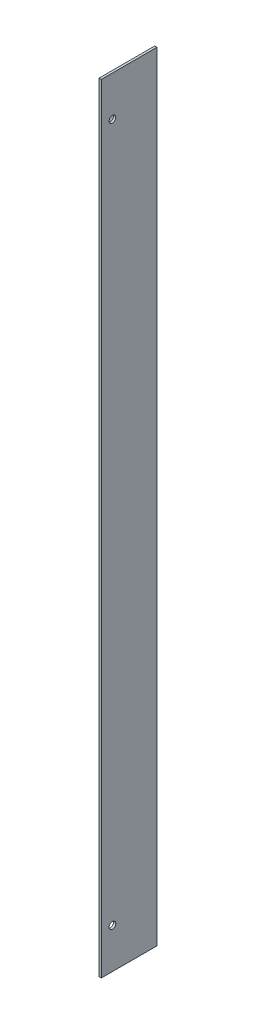
ISO-10303-21;
HEADER;
FILE_DESCRIPTION(('STEP AP214'),'2;1');
FILE_NAME('part.step','',(''),(''),'','','');
FILE_SCHEMA(('AUTOMOTIVE_DESIGN { 1 0 10303 214 1 1 1 1 }'));
ENDSEC;
DATA;
#1=APPLICATION_CONTEXT('core data for automotive mechanical design processes');
#2=APPLICATION_PROTOCOL_DEFINITION('international standard','automotive_design',2000,#1);
#3=PRODUCT_CONTEXT('',#1,'mechanical');
#4=PRODUCT('Part','Part','',(#3));
#5=PRODUCT_RELATED_PRODUCT_CATEGORY('part','',(#4));
#6=PRODUCT_DEFINITION_FORMATION('','',#4);
#7=PRODUCT_DEFINITION_CONTEXT('part definition',#1,'design');
#8=PRODUCT_DEFINITION('design','',#6,#7);
#9=PRODUCT_DEFINITION_SHAPE('','',#8);
#10=(LENGTH_UNIT() NAMED_UNIT(*) SI_UNIT(.MILLI.,.METRE.));
#11=(NAMED_UNIT(*) PLANE_ANGLE_UNIT() SI_UNIT($,.RADIAN.));
#12=(NAMED_UNIT(*) SI_UNIT($,.STERADIAN.) SOLID_ANGLE_UNIT());
#13=UNCERTAINTY_MEASURE_WITH_UNIT(LENGTH_MEASURE(1.E-05),#10,'distance_accuracy_value','');
#14=(GEOMETRIC_REPRESENTATION_CONTEXT(3) GLOBAL_UNCERTAINTY_ASSIGNED_CONTEXT((#13)) GLOBAL_UNIT_ASSIGNED_CONTEXT((#10,
#11,#12)) REPRESENTATION_CONTEXT('',''));
#15=CARTESIAN_POINT('',(0.,0.,0.));
#16=DIRECTION('',(0.,0.,1.));
#17=DIRECTION('',(1.,0.,0.));
#18=AXIS2_PLACEMENT_3D('',#15,#16,#17);
#19=CARTESIAN_POINT('',(-55.4417853066137,61.1803752262789,25.));
#20=DIRECTION('',(1.,0.,0.));
#21=DIRECTION('',(0.,1.,0.));
#22=AXIS2_PLACEMENT_3D('',#19,#20,#21);
#23=PLANE('',#22);
#24=CARTESIAN_POINT('',(-55.4417853066137,43.1803752262789,20.));
#25=DIRECTION('',(1.,0.,0.));
#26=DIRECTION('',(0.,1.,0.));
#27=AXIS2_PLACEMENT_3D('',#24,#25,#26);
#28=CIRCLE('',#27,1.5);
#29=CARTESIAN_POINT('',(-55.4417853066137,44.6803752262789,20.));
#30=VERTEX_POINT('',#29);
#31=EDGE_CURVE('E149',#30,#30,#28,.T.);
#32=ORIENTED_EDGE('',*,*,#31,.T.);
#33=EDGE_LOOP('',(#32));
#34=FACE_BOUND('',#33,.T.);
#35=CARTESIAN_POINT('',(-55.4417853066137,-270.819624773721,20.));
#36=DIRECTION('',(1.,0.,0.));
#37=DIRECTION('',(0.,1.,0.));
#38=AXIS2_PLACEMENT_3D('',#35,#36,#37);
#39=CIRCLE('',#38,1.5);
#40=CARTESIAN_POINT('',(-55.4417853066137,-269.319624773721,20.));
#41=VERTEX_POINT('',#40);
#42=EDGE_CURVE('E140',#41,#41,#39,.T.);
#43=ORIENTED_EDGE('',*,*,#42,.T.);
#44=EDGE_LOOP('',(#43));
#45=FACE_BOUND('',#44,.T.);
#46=DIRECTION('',(0.,1.,0.));
#47=VECTOR('',#46,1.);
#48=CARTESIAN_POINT('',(-55.4417853066131,61.1803752262784,1.));
#49=LINE('',#48,#47);
#50=CARTESIAN_POINT('',(-55.4417853066137,-288.819624773721,1.));
#51=VERTEX_POINT('',#50);
#52=CARTESIAN_POINT('',(-55.4417853066131,61.1803752262784,1.));
#53=VERTEX_POINT('',#52);
#54=EDGE_CURVE('E48',#51,#53,#49,.T.);
#55=ORIENTED_EDGE('',*,*,#54,.F.);
#56=DIRECTION('',(0.,0.,-1.));
#57=VECTOR('',#56,1.);
#58=CARTESIAN_POINT('',(-55.4417853066137,-288.819624773721,25.));
#59=LINE('',#58,#57);
#60=CARTESIAN_POINT('',(-55.4417853066137,-288.819624773721,25.));
#61=VERTEX_POINT('',#60);
#62=EDGE_CURVE('E11',#61,#51,#59,.T.);
#63=ORIENTED_EDGE('',*,*,#62,.F.);
#64=DIRECTION('',(0.,-1.,0.));
#65=VECTOR('',#64,1.);
#66=CARTESIAN_POINT('',(-55.4417853066137,61.1803752262789,25.));
#67=LINE('',#66,#65);
#68=CARTESIAN_POINT('',(-55.4417853066137,61.1803752262789,25.));
#69=VERTEX_POINT('',#68);
#70=EDGE_CURVE('E101',#69,#61,#67,.T.);
#71=ORIENTED_EDGE('',*,*,#70,.F.);
#72=DIRECTION('',(0.,0.,-1.));
#73=VECTOR('',#72,1.);
#74=CARTESIAN_POINT('',(-55.4417853066137,61.1803752262789,25.));
#75=LINE('',#74,#73);
#76=EDGE_CURVE('E100',#69,#53,#75,.T.);
#77=ORIENTED_EDGE('',*,*,#76,.T.);
#78=EDGE_LOOP('',(#55,#63,#71,#77));
#79=FACE_BOUND('',#78,.T.);
#80=ADVANCED_FACE('F32',(#34,#45,#79),#23,.F.);
#81=CARTESIAN_POINT('',(-55.4417853066137,-288.819624773721,25.));
#82=DIRECTION('',(0.,1.,0.));
#83=DIRECTION('',(0.,0.,1.));
#84=AXIS2_PLACEMENT_3D('',#81,#82,#83);
#85=PLANE('',#84);
#86=DIRECTION('',(1.,0.,0.));
#87=VECTOR('',#86,1.);
#88=CARTESIAN_POINT('',(-55.4417853066137,-288.819624773721,0.));
#89=LINE('',#88,#87);
#90=CARTESIAN_POINT('',(-55.4417853066137,-288.819624773721,0.));
#91=VERTEX_POINT('',#90);
#92=CARTESIAN_POINT('',(-54.4417853066137,-288.819624773721,0.));
#93=VERTEX_POINT('',#92);
#94=EDGE_CURVE('E152',#91,#93,#89,.T.);
#95=ORIENTED_EDGE('',*,*,#94,.T.);
#96=DIRECTION('',(0.,0.,-1.));
#97=VECTOR('',#96,1.);
#98=CARTESIAN_POINT('',(-54.4417853066137,-288.819624773721,25.));
#99=LINE('',#98,#97);
#100=CARTESIAN_POINT('',(-54.4417853066137,-288.819624773721,25.));
#101=VERTEX_POINT('',#100);
#102=EDGE_CURVE('E40',#101,#93,#99,.T.);
#103=ORIENTED_EDGE('',*,*,#102,.F.);
#104=DIRECTION('',(1.,0.,0.));
#105=VECTOR('',#104,1.);
#106=CARTESIAN_POINT('',(-55.4417853066137,-288.819624773721,25.));
#107=LINE('',#106,#105);
#108=EDGE_CURVE('E85',#61,#101,#107,.T.);
#109=ORIENTED_EDGE('',*,*,#108,.F.);
#110=ORIENTED_EDGE('',*,*,#62,.T.);
#111=DIRECTION('',(0.,0.,-1.));
#112=VECTOR('',#111,1.);
#113=CARTESIAN_POINT('',(-55.4417853066131,-288.819624773722,1.));
#114=LINE('',#113,#112);
#115=EDGE_CURVE('E109',#51,#91,#114,.T.);
#116=ORIENTED_EDGE('',*,*,#115,.T.);
#117=EDGE_LOOP('',(#95,#103,#109,#110,#116));
#118=FACE_BOUND('',#117,.T.);
#119=ADVANCED_FACE('F205',(#118),#85,.F.);
#120=CARTESIAN_POINT('',(-54.4417853066137,61.1803752262789,25.));
#121=DIRECTION('',(-1.,0.,0.));
#122=DIRECTION('',(0.,-1.,0.));
#123=AXIS2_PLACEMENT_3D('',#120,#121,#122);
#124=PLANE('',#123);
#125=CARTESIAN_POINT('',(-54.4417853066137,-270.819624773721,20.));
#126=DIRECTION('',(1.,0.,0.));
#127=DIRECTION('',(0.,1.,0.));
#128=AXIS2_PLACEMENT_3D('',#125,#126,#127);
#129=CIRCLE('',#128,1.5);
#130=CARTESIAN_POINT('',(-54.4417853066137,-269.319624773721,20.));
#131=VERTEX_POINT('',#130);
#132=EDGE_CURVE('E137',#131,#131,#129,.T.);
#133=ORIENTED_EDGE('',*,*,#132,.F.);
#134=EDGE_LOOP('',(#133));
#135=FACE_BOUND('',#134,.T.);
#136=CARTESIAN_POINT('',(-54.4417853066137,43.1803752262789,20.));
#137=DIRECTION('',(1.,0.,0.));
#138=DIRECTION('',(0.,1.,0.));
#139=AXIS2_PLACEMENT_3D('',#136,#137,#138);
#140=CIRCLE('',#139,1.5);
#141=CARTESIAN_POINT('',(-54.4417853066137,44.6803752262789,20.));
#142=VERTEX_POINT('',#141);
#143=EDGE_CURVE('E145',#142,#142,#140,.T.);
#144=ORIENTED_EDGE('',*,*,#143,.F.);
#145=EDGE_LOOP('',(#144));
#146=FACE_BOUND('',#145,.T.);
#147=DIRECTION('',(0.,1.,0.));
#148=VECTOR('',#147,1.);
#149=CARTESIAN_POINT('',(-54.4417853066137,61.1803752262789,0.));
#150=LINE('',#149,#148);
#151=CARTESIAN_POINT('',(-54.4417853066137,61.1803752262789,0.));
#152=VERTEX_POINT('',#151);
#153=EDGE_CURVE('E161',#93,#152,#150,.T.);
#154=ORIENTED_EDGE('',*,*,#153,.T.);
#155=DIRECTION('',(0.,0.,-1.));
#156=VECTOR('',#155,1.);
#157=CARTESIAN_POINT('',(-54.4417853066137,61.1803752262789,25.));
#158=LINE('',#157,#156);
#159=CARTESIAN_POINT('',(-54.4417853066137,61.1803752262789,25.));
#160=VERTEX_POINT('',#159);
#161=EDGE_CURVE('E102',#160,#152,#158,.T.);
#162=ORIENTED_EDGE('',*,*,#161,.F.);
#163=DIRECTION('',(0.,1.,0.));
#164=VECTOR('',#163,1.);
#165=CARTESIAN_POINT('',(-54.4417853066137,61.1803752262789,25.));
#166=LINE('',#165,#164);
#167=EDGE_CURVE('E157',#101,#160,#166,.T.);
#168=ORIENTED_EDGE('',*,*,#167,.F.);
#169=ORIENTED_EDGE('',*,*,#102,.T.);
#170=EDGE_LOOP('',(#154,#162,#168,#169));
#171=FACE_BOUND('',#170,.T.);
#172=ADVANCED_FACE('F210',(#135,#146,#171),#124,.F.);
#173=CARTESIAN_POINT('',(-55.4417853066137,61.1803752262789,25.));
#174=DIRECTION('',(0.,-1.,0.));
#175=DIRECTION('',(0.,0.,-1.));
#176=AXIS2_PLACEMENT_3D('',#173,#174,#175);
#177=PLANE('',#176);
#178=DIRECTION('',(-1.,0.,0.));
#179=VECTOR('',#178,1.);
#180=CARTESIAN_POINT('',(-55.4417853066137,61.1803752262789,0.));
#181=LINE('',#180,#179);
#182=CARTESIAN_POINT('',(-55.4417853066137,61.1803752262789,0.));
#183=VERTEX_POINT('',#182);
#184=EDGE_CURVE('E78',#152,#183,#181,.T.);
#185=ORIENTED_EDGE('',*,*,#184,.T.);
#186=DIRECTION('',(0.,0.,-1.));
#187=VECTOR('',#186,1.);
#188=CARTESIAN_POINT('',(-55.4417853066131,61.1803752262784,1.));
#189=LINE('',#188,#187);
#190=EDGE_CURVE('E104',#53,#183,#189,.T.);
#191=ORIENTED_EDGE('',*,*,#190,.F.);
#192=ORIENTED_EDGE('',*,*,#76,.F.);
#193=DIRECTION('',(-1.,0.,0.));
#194=VECTOR('',#193,1.);
#195=CARTESIAN_POINT('',(-55.4417853066137,61.1803752262789,25.));
#196=LINE('',#195,#194);
#197=EDGE_CURVE('E56',#160,#69,#196,.T.);
#198=ORIENTED_EDGE('',*,*,#197,.F.);
#199=ORIENTED_EDGE('',*,*,#161,.T.);
#200=EDGE_LOOP('',(#185,#191,#192,#198,#199));
#201=FACE_BOUND('',#200,.T.);
#202=ADVANCED_FACE('F105',(#201),#177,.F.);
#203=CARTESIAN_POINT('',(0.,0.,25.));
#204=DIRECTION('',(0.,0.,1.));
#205=DIRECTION('',(1.,0.,0.));
#206=AXIS2_PLACEMENT_3D('',#203,#204,#205);
#207=PLANE('',#206);
#208=ORIENTED_EDGE('',*,*,#70,.T.);
#209=ORIENTED_EDGE('',*,*,#108,.T.);
#210=ORIENTED_EDGE('',*,*,#167,.T.);
#211=ORIENTED_EDGE('',*,*,#197,.T.);
#212=EDGE_LOOP('',(#208,#209,#210,#211));
#213=FACE_BOUND('',#212,.T.);
#214=ADVANCED_FACE('F223',(#213),#207,.T.);
#215=CARTESIAN_POINT('',(0.,0.,0.));
#216=DIRECTION('',(0.,0.,1.));
#217=DIRECTION('',(1.,0.,0.));
#218=AXIS2_PLACEMENT_3D('',#215,#216,#217);
#219=PLANE('',#218);
#220=ORIENTED_EDGE('',*,*,#94,.F.);
#221=DIRECTION('',(0.707106781186544,-0.707106781186551,0.));
#222=VECTOR('',#221,1.);
#223=CARTESIAN_POINT('',(-55.4417853066131,-288.819624773722,0.));
#224=LINE('',#223,#222);
#225=CARTESIAN_POINT('',(-79.4417853066137,-264.819624773721,0.));
#226=VERTEX_POINT('',#225);
#227=EDGE_CURVE('E174',#226,#91,#224,.T.);
#228=ORIENTED_EDGE('',*,*,#227,.F.);
#229=DIRECTION('',(0.,-1.,0.));
#230=VECTOR('',#229,1.);
#231=CARTESIAN_POINT('',(-79.4417853066137,-264.819624773721,0.));
#232=LINE('',#231,#230);
#233=CARTESIAN_POINT('',(-79.4417853066137,37.1803752262788,0.));
#234=VERTEX_POINT('',#233);
#235=EDGE_CURVE('E135',#234,#226,#232,.T.);
#236=ORIENTED_EDGE('',*,*,#235,.F.);
#237=DIRECTION('',(-0.707106781186561,-0.707106781186535,0.));
#238=VECTOR('',#237,1.);
#239=CARTESIAN_POINT('',(-55.4417853066131,61.1803752262784,0.));
#240=LINE('',#239,#238);
#241=EDGE_CURVE('E177',#183,#234,#240,.T.);
#242=ORIENTED_EDGE('',*,*,#241,.F.);
#243=ORIENTED_EDGE('',*,*,#184,.F.);
#244=ORIENTED_EDGE('',*,*,#153,.F.);
#245=EDGE_LOOP('',(#220,#228,#236,#242,#243,#244));
#246=FACE_BOUND('',#245,.T.);
#247=CARTESIAN_POINT('',(-74.4417853066127,1.18037522627845,0.));
#248=DIRECTION('',(0.,0.,1.));
#249=DIRECTION('',(1.,0.,0.));
#250=AXIS2_PLACEMENT_3D('',#247,#248,#249);
#251=CIRCLE('',#250,1.5);
#252=CARTESIAN_POINT('',(-72.9417853066127,1.18037522627845,0.));
#253=VERTEX_POINT('',#252);
#254=EDGE_CURVE('E171',#253,#253,#251,.T.);
#255=ORIENTED_EDGE('',*,*,#254,.T.);
#256=EDGE_LOOP('',(#255));
#257=FACE_BOUND('',#256,.T.);
#258=CARTESIAN_POINT('',(-74.4417853066136,-228.819624773722,0.));
#259=DIRECTION('',(0.,0.,1.));
#260=DIRECTION('',(1.,0.,0.));
#261=AXIS2_PLACEMENT_3D('',#258,#259,#260);
#262=CIRCLE('',#261,1.5);
#263=CARTESIAN_POINT('',(-72.9417853066136,-228.819624773722,0.));
#264=VERTEX_POINT('',#263);
#265=EDGE_CURVE('E336',#264,#264,#262,.T.);
#266=ORIENTED_EDGE('',*,*,#265,.T.);
#267=EDGE_LOOP('',(#266));
#268=FACE_BOUND('',#267,.T.);
#269=ADVANCED_FACE('F188',(#246,#257,#268),#219,.F.);
#270=CARTESIAN_POINT('',(-55.4417853066137,43.1803752262789,20.));
#271=DIRECTION('',(1.,0.,0.));
#272=DIRECTION('',(0.,1.,0.));
#273=AXIS2_PLACEMENT_3D('',#270,#271,#272);
#274=CYLINDRICAL_SURFACE('',#273,1.5);
#275=ORIENTED_EDGE('',*,*,#31,.F.);
#276=EDGE_LOOP('',(#275));
#277=FACE_BOUND('',#276,.T.);
#278=ORIENTED_EDGE('',*,*,#143,.T.);
#279=EDGE_LOOP('',(#278));
#280=FACE_BOUND('',#279,.T.);
#281=ADVANCED_FACE('F216',(#277,#280),#274,.F.);
#282=CARTESIAN_POINT('',(-55.4417853066137,-270.819624773721,20.));
#283=DIRECTION('',(1.,0.,0.));
#284=DIRECTION('',(0.,1.,0.));
#285=AXIS2_PLACEMENT_3D('',#282,#283,#284);
#286=CYLINDRICAL_SURFACE('',#285,1.5);
#287=ORIENTED_EDGE('',*,*,#42,.F.);
#288=EDGE_LOOP('',(#287));
#289=FACE_BOUND('',#288,.T.);
#290=ORIENTED_EDGE('',*,*,#132,.T.);
#291=EDGE_LOOP('',(#290));
#292=FACE_BOUND('',#291,.T.);
#293=ADVANCED_FACE('F200',(#289,#292),#286,.F.);
#294=CARTESIAN_POINT('',(0.,0.,1.));
#295=DIRECTION('',(0.,0.,1.));
#296=DIRECTION('',(1.,0.,0.));
#297=AXIS2_PLACEMENT_3D('',#294,#295,#296);
#298=PLANE('',#297);
#299=CARTESIAN_POINT('',(-74.4417853066127,1.18037522627845,1.));
#300=DIRECTION('',(0.,0.,1.));
#301=DIRECTION('',(1.,0.,0.));
#302=AXIS2_PLACEMENT_3D('',#299,#300,#301);
#303=CIRCLE('',#302,1.5);
#304=CARTESIAN_POINT('',(-72.9417853066127,1.18037522627845,1.));
#305=VERTEX_POINT('',#304);
#306=EDGE_CURVE('E178',#305,#305,#303,.T.);
#307=ORIENTED_EDGE('',*,*,#306,.F.);
#308=EDGE_LOOP('',(#307));
#309=FACE_BOUND('',#308,.T.);
#310=DIRECTION('',(0.707106781186544,-0.707106781186551,0.));
#311=VECTOR('',#310,1.);
#312=CARTESIAN_POINT('',(-55.4417853066131,-288.819624773722,1.));
#313=LINE('',#312,#311);
#314=CARTESIAN_POINT('',(-79.4417853066137,-264.819624773721,1.));
#315=VERTEX_POINT('',#314);
#316=EDGE_CURVE('E119',#315,#51,#313,.T.);
#317=ORIENTED_EDGE('',*,*,#316,.T.);
#318=ORIENTED_EDGE('',*,*,#54,.T.);
#319=DIRECTION('',(-0.707106781186561,-0.707106781186535,0.));
#320=VECTOR('',#319,1.);
#321=CARTESIAN_POINT('',(-55.4417853066131,61.1803752262784,1.));
#322=LINE('',#321,#320);
#323=CARTESIAN_POINT('',(-79.4417853066137,37.1803752262788,1.));
#324=VERTEX_POINT('',#323);
#325=EDGE_CURVE('E116',#53,#324,#322,.T.);
#326=ORIENTED_EDGE('',*,*,#325,.T.);
#327=DIRECTION('',(0.,-1.,0.));
#328=VECTOR('',#327,1.);
#329=CARTESIAN_POINT('',(-79.4417853066137,-264.819624773721,1.));
#330=LINE('',#329,#328);
#331=EDGE_CURVE('E125',#324,#315,#330,.T.);
#332=ORIENTED_EDGE('',*,*,#331,.T.);
#333=EDGE_LOOP('',(#317,#318,#326,#332));
#334=FACE_BOUND('',#333,.T.);
#335=CARTESIAN_POINT('',(-74.4417853066136,-228.819624773722,1.));
#336=DIRECTION('',(0.,0.,1.));
#337=DIRECTION('',(1.,0.,0.));
#338=AXIS2_PLACEMENT_3D('',#335,#336,#337);
#339=CIRCLE('',#338,1.5);
#340=CARTESIAN_POINT('',(-72.9417853066136,-228.819624773722,1.));
#341=VERTEX_POINT('',#340);
#342=EDGE_CURVE('E333',#341,#341,#339,.T.);
#343=ORIENTED_EDGE('',*,*,#342,.F.);
#344=EDGE_LOOP('',(#343));
#345=FACE_BOUND('',#344,.T.);
#346=ADVANCED_FACE('F114',(#309,#334,#345),#298,.T.);
#347=CARTESIAN_POINT('',(-55.4417853066131,-288.819624773722,1.));
#348=DIRECTION('',(0.707106781186551,0.707106781186544,0.));
#349=DIRECTION('',(-0.707106781186544,0.707106781186551,0.));
#350=AXIS2_PLACEMENT_3D('',#347,#348,#349);
#351=PLANE('',#350);
#352=ORIENTED_EDGE('',*,*,#227,.T.);
#353=ORIENTED_EDGE('',*,*,#115,.F.);
#354=ORIENTED_EDGE('',*,*,#316,.F.);
#355=DIRECTION('',(0.,0.,-1.));
#356=VECTOR('',#355,1.);
#357=CARTESIAN_POINT('',(-79.4417853066137,-264.819624773721,1.));
#358=LINE('',#357,#356);
#359=EDGE_CURVE('E127',#315,#226,#358,.T.);
#360=ORIENTED_EDGE('',*,*,#359,.T.);
#361=EDGE_LOOP('',(#352,#353,#354,#360));
#362=FACE_BOUND('',#361,.T.);
#363=ADVANCED_FACE('F192',(#362),#351,.F.);
#364=CARTESIAN_POINT('',(-55.4417853066131,61.1803752262784,1.));
#365=DIRECTION('',(0.707106781186535,-0.707106781186561,0.));
#366=DIRECTION('',(0.707106781186561,0.707106781186535,0.));
#367=AXIS2_PLACEMENT_3D('',#364,#365,#366);
#368=PLANE('',#367);
#369=ORIENTED_EDGE('',*,*,#241,.T.);
#370=DIRECTION('',(0.,0.,-1.));
#371=VECTOR('',#370,1.);
#372=CARTESIAN_POINT('',(-79.4417853066137,37.1803752262788,1.));
#373=LINE('',#372,#371);
#374=EDGE_CURVE('E110',#324,#234,#373,.T.);
#375=ORIENTED_EDGE('',*,*,#374,.F.);
#376=ORIENTED_EDGE('',*,*,#325,.F.);
#377=ORIENTED_EDGE('',*,*,#190,.T.);
#378=EDGE_LOOP('',(#369,#375,#376,#377));
#379=FACE_BOUND('',#378,.T.);
#380=ADVANCED_FACE('F122',(#379),#368,.F.);
#381=CARTESIAN_POINT('',(-79.4417853066137,-264.819624773721,1.));
#382=DIRECTION('',(1.,0.,0.));
#383=DIRECTION('',(0.,0.,-1.));
#384=AXIS2_PLACEMENT_3D('',#381,#382,#383);
#385=PLANE('',#384);
#386=ORIENTED_EDGE('',*,*,#235,.T.);
#387=ORIENTED_EDGE('',*,*,#359,.F.);
#388=ORIENTED_EDGE('',*,*,#331,.F.);
#389=ORIENTED_EDGE('',*,*,#374,.T.);
#390=EDGE_LOOP('',(#386,#387,#388,#389));
#391=FACE_BOUND('',#390,.T.);
#392=ADVANCED_FACE('F184',(#391),#385,.F.);
#393=CARTESIAN_POINT('',(-74.4417853066127,1.18037522627845,1.));
#394=DIRECTION('',(0.,0.,-1.));
#395=DIRECTION('',(-1.,0.,0.));
#396=AXIS2_PLACEMENT_3D('',#393,#394,#395);
#397=CYLINDRICAL_SURFACE('',#396,1.5);
#398=ORIENTED_EDGE('',*,*,#306,.T.);
#399=EDGE_LOOP('',(#398));
#400=FACE_BOUND('',#399,.T.);
#401=ORIENTED_EDGE('',*,*,#254,.F.);
#402=EDGE_LOOP('',(#401));
#403=FACE_BOUND('',#402,.T.);
#404=ADVANCED_FACE('F307',(#400,#403),#397,.F.);
#405=CARTESIAN_POINT('',(-74.4417853066136,-228.819624773722,1.));
#406=DIRECTION('',(0.,0.,-1.));
#407=DIRECTION('',(-1.,0.,0.));
#408=AXIS2_PLACEMENT_3D('',#405,#406,#407);
#409=CYLINDRICAL_SURFACE('',#408,1.5);
#410=ORIENTED_EDGE('',*,*,#342,.T.);
#411=EDGE_LOOP('',(#410));
#412=FACE_BOUND('',#411,.T.);
#413=ORIENTED_EDGE('',*,*,#265,.F.);
#414=EDGE_LOOP('',(#413));
#415=FACE_BOUND('',#414,.T.);
#416=ADVANCED_FACE('F315',(#412,#415),#409,.F.);
#417=CLOSED_SHELL('',(#80,#119,#172,#202,#214,#269,#281,#293,#346,#363,#380,#392,#404,#416));
#418=MANIFOLD_SOLID_BREP('B2',#417);
#419=ADVANCED_BREP_SHAPE_REPRESENTATION('',(#18,#418),#14);
#420=SHAPE_DEFINITION_REPRESENTATION(#9,#419);
ENDSEC;
END-ISO-10303-21;
